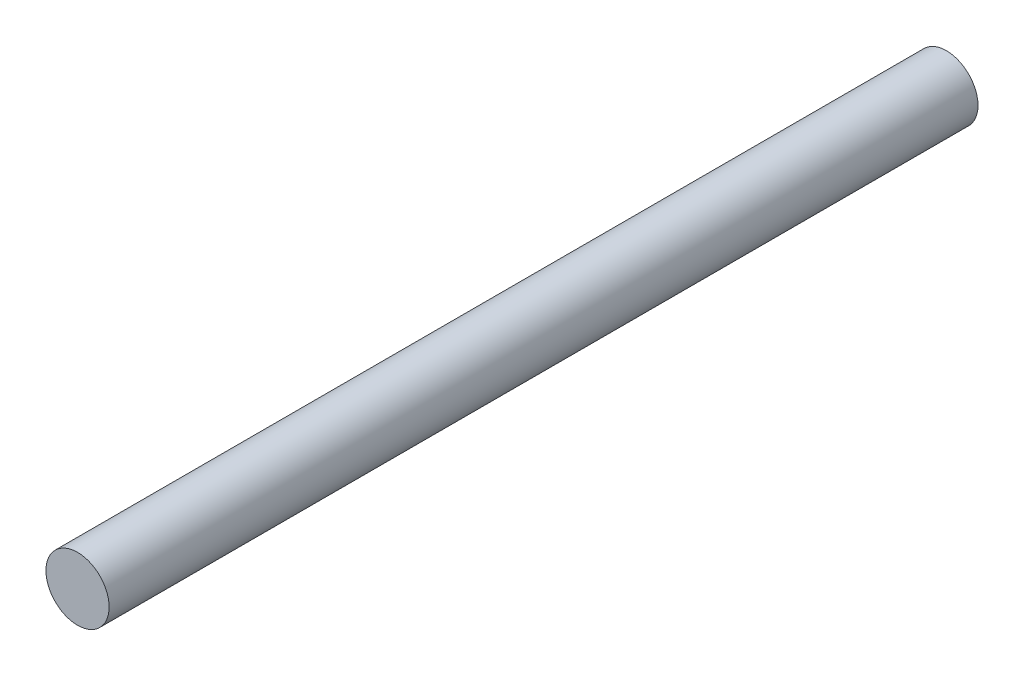
ISO-10303-21;
HEADER;
FILE_DESCRIPTION(('STEP AP214'),'2;1');
FILE_NAME('part.step','',(''),(''),'','','');
FILE_SCHEMA(('AUTOMOTIVE_DESIGN { 1 0 10303 214 1 1 1 1 }'));
ENDSEC;
DATA;
#1=APPLICATION_CONTEXT('core data for automotive mechanical design processes');
#2=APPLICATION_PROTOCOL_DEFINITION('international standard','automotive_design',2000,#1);
#3=PRODUCT_CONTEXT('',#1,'mechanical');
#4=PRODUCT('Part','Part','',(#3));
#5=PRODUCT_RELATED_PRODUCT_CATEGORY('part','',(#4));
#6=PRODUCT_DEFINITION_FORMATION('','',#4);
#7=PRODUCT_DEFINITION_CONTEXT('part definition',#1,'design');
#8=PRODUCT_DEFINITION('design','',#6,#7);
#9=PRODUCT_DEFINITION_SHAPE('','',#8);
#10=(LENGTH_UNIT() NAMED_UNIT(*) SI_UNIT(.MILLI.,.METRE.));
#11=(NAMED_UNIT(*) PLANE_ANGLE_UNIT() SI_UNIT($,.RADIAN.));
#12=(NAMED_UNIT(*) SI_UNIT($,.STERADIAN.) SOLID_ANGLE_UNIT());
#13=UNCERTAINTY_MEASURE_WITH_UNIT(LENGTH_MEASURE(1.E-05),#10,'distance_accuracy_value','');
#14=(GEOMETRIC_REPRESENTATION_CONTEXT(3) GLOBAL_UNCERTAINTY_ASSIGNED_CONTEXT((#13)) GLOBAL_UNIT_ASSIGNED_CONTEXT((#10,
#11,#12)) REPRESENTATION_CONTEXT('',''));
#15=CARTESIAN_POINT('',(0.,0.,0.));
#16=DIRECTION('',(0.,0.,1.));
#17=DIRECTION('',(1.,0.,0.));
#18=AXIS2_PLACEMENT_3D('',#15,#16,#17);
#19=CARTESIAN_POINT('',(0.,0.,110.));
#20=DIRECTION('',(0.,0.,-1.));
#21=DIRECTION('',(-1.,0.,0.));
#22=AXIS2_PLACEMENT_3D('',#19,#20,#21);
#23=CYLINDRICAL_SURFACE('',#22,4.);
#24=CARTESIAN_POINT('',(0.,0.,110.));
#25=DIRECTION('',(0.,0.,1.));
#26=DIRECTION('',(1.,0.,0.));
#27=AXIS2_PLACEMENT_3D('',#24,#25,#26);
#28=CIRCLE('',#27,4.);
#29=CARTESIAN_POINT('',(4.,0.,110.));
#30=VERTEX_POINT('',#29);
#31=EDGE_CURVE('E10',#30,#30,#28,.T.);
#32=ORIENTED_EDGE('',*,*,#31,.F.);
#33=EDGE_LOOP('',(#32));
#34=FACE_BOUND('',#33,.T.);
#35=CARTESIAN_POINT('',(0.,0.,0.));
#36=DIRECTION('',(0.,0.,1.));
#37=DIRECTION('',(1.,0.,0.));
#38=AXIS2_PLACEMENT_3D('',#35,#36,#37);
#39=CIRCLE('',#38,4.);
#40=CARTESIAN_POINT('',(4.,0.,0.));
#41=VERTEX_POINT('',#40);
#42=EDGE_CURVE('E42',#41,#41,#39,.T.);
#43=ORIENTED_EDGE('',*,*,#42,.T.);
#44=EDGE_LOOP('',(#43));
#45=FACE_BOUND('',#44,.T.);
#46=ADVANCED_FACE('F39',(#34,#45),#23,.T.);
#47=CARTESIAN_POINT('',(0.,0.,110.));
#48=DIRECTION('',(0.,0.,1.));
#49=DIRECTION('',(1.,0.,0.));
#50=AXIS2_PLACEMENT_3D('',#47,#48,#49);
#51=PLANE('',#50);
#52=ORIENTED_EDGE('',*,*,#31,.T.);
#53=EDGE_LOOP('',(#52));
#54=FACE_BOUND('',#53,.T.);
#55=ADVANCED_FACE('F56',(#54),#51,.T.);
#56=CARTESIAN_POINT('',(0.,0.,0.));
#57=DIRECTION('',(0.,0.,1.));
#58=DIRECTION('',(1.,0.,0.));
#59=AXIS2_PLACEMENT_3D('',#56,#57,#58);
#60=PLANE('',#59);
#61=ORIENTED_EDGE('',*,*,#42,.F.);
#62=EDGE_LOOP('',(#61));
#63=FACE_BOUND('',#62,.T.);
#64=ADVANCED_FACE('F54',(#63),#60,.F.);
#65=CLOSED_SHELL('',(#46,#55,#64));
#66=MANIFOLD_SOLID_BREP('B2',#65);
#67=ADVANCED_BREP_SHAPE_REPRESENTATION('',(#18,#66),#14);
#68=SHAPE_DEFINITION_REPRESENTATION(#9,#67);
ENDSEC;
END-ISO-10303-21;
